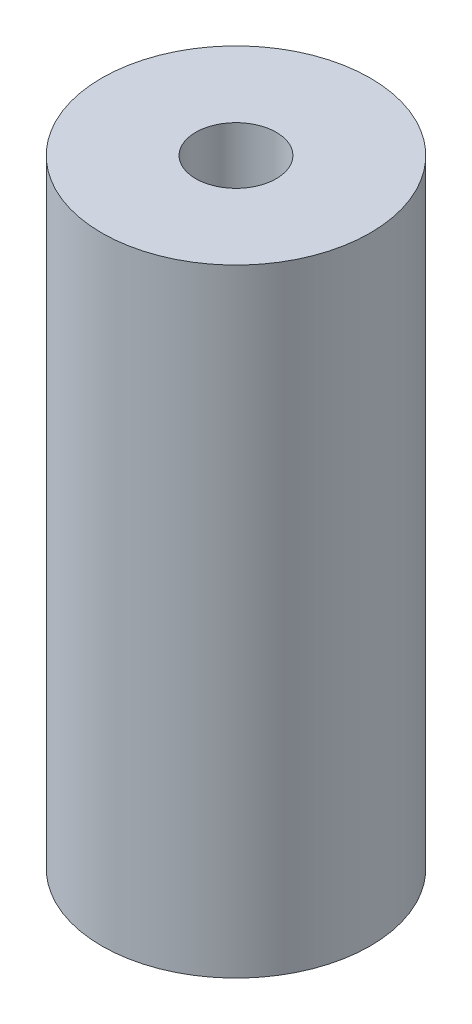
ISO-10303-21;
HEADER;
FILE_DESCRIPTION(('STEP AP214'),'2;1');
FILE_NAME('part.step','',(''),(''),'','','');
FILE_SCHEMA(('AUTOMOTIVE_DESIGN { 1 0 10303 214 1 1 1 1 }'));
ENDSEC;
DATA;
#1=APPLICATION_CONTEXT('core data for automotive mechanical design processes');
#2=APPLICATION_PROTOCOL_DEFINITION('international standard','automotive_design',2000,#1);
#3=PRODUCT_CONTEXT('',#1,'mechanical');
#4=PRODUCT('Part','Part','',(#3));
#5=PRODUCT_RELATED_PRODUCT_CATEGORY('part','',(#4));
#6=PRODUCT_DEFINITION_FORMATION('','',#4);
#7=PRODUCT_DEFINITION_CONTEXT('part definition',#1,'design');
#8=PRODUCT_DEFINITION('design','',#6,#7);
#9=PRODUCT_DEFINITION_SHAPE('','',#8);
#10=(LENGTH_UNIT() NAMED_UNIT(*) SI_UNIT(.MILLI.,.METRE.));
#11=(NAMED_UNIT(*) PLANE_ANGLE_UNIT() SI_UNIT($,.RADIAN.));
#12=(NAMED_UNIT(*) SI_UNIT($,.STERADIAN.) SOLID_ANGLE_UNIT());
#13=UNCERTAINTY_MEASURE_WITH_UNIT(LENGTH_MEASURE(1.E-05),#10,'distance_accuracy_value','');
#14=(GEOMETRIC_REPRESENTATION_CONTEXT(3) GLOBAL_UNCERTAINTY_ASSIGNED_CONTEXT((#13)) GLOBAL_UNIT_ASSIGNED_CONTEXT((#10,
#11,#12)) REPRESENTATION_CONTEXT('',''));
#15=CARTESIAN_POINT('',(0.,0.,0.));
#16=DIRECTION('',(0.,0.,1.));
#17=DIRECTION('',(1.,0.,0.));
#18=AXIS2_PLACEMENT_3D('',#15,#16,#17);
#19=CARTESIAN_POINT('',(0.,23.,0.));
#20=DIRECTION('',(0.,-1.,0.));
#21=DIRECTION('',(0.,0.,-1.));
#22=AXIS2_PLACEMENT_3D('',#19,#20,#21);
#23=CYLINDRICAL_SURFACE('',#22,5.);
#24=CARTESIAN_POINT('',(0.,23.,0.));
#25=DIRECTION('',(0.,1.,0.));
#26=DIRECTION('',(0.,0.,1.));
#27=AXIS2_PLACEMENT_3D('',#24,#25,#26);
#28=CIRCLE('',#27,5.);
#29=CARTESIAN_POINT('',(0.,23.,5.));
#30=VERTEX_POINT('',#29);
#31=EDGE_CURVE('E10',#30,#30,#28,.T.);
#32=ORIENTED_EDGE('',*,*,#31,.F.);
#33=EDGE_LOOP('',(#32));
#34=FACE_BOUND('',#33,.T.);
#35=CARTESIAN_POINT('',(0.,0.,0.));
#36=DIRECTION('',(0.,1.,0.));
#37=DIRECTION('',(0.,0.,1.));
#38=AXIS2_PLACEMENT_3D('',#35,#36,#37);
#39=CIRCLE('',#38,5.);
#40=CARTESIAN_POINT('',(0.,0.,5.));
#41=VERTEX_POINT('',#40);
#42=EDGE_CURVE('E34',#41,#41,#39,.T.);
#43=ORIENTED_EDGE('',*,*,#42,.T.);
#44=EDGE_LOOP('',(#43));
#45=FACE_BOUND('',#44,.T.);
#46=ADVANCED_FACE('F31',(#34,#45),#23,.T.);
#47=CARTESIAN_POINT('',(0.,23.,0.));
#48=DIRECTION('',(0.,1.,0.));
#49=DIRECTION('',(0.,0.,1.));
#50=AXIS2_PLACEMENT_3D('',#47,#48,#49);
#51=PLANE('',#50);
#52=CARTESIAN_POINT('',(0.,23.,0.));
#53=DIRECTION('',(0.,1.,0.));
#54=DIRECTION('',(0.,0.,1.));
#55=AXIS2_PLACEMENT_3D('',#52,#53,#54);
#56=CIRCLE('',#55,1.5);
#57=CARTESIAN_POINT('',(0.,23.,1.5));
#58=VERTEX_POINT('',#57);
#59=EDGE_CURVE('E43',#58,#58,#56,.T.);
#60=ORIENTED_EDGE('',*,*,#59,.F.);
#61=EDGE_LOOP('',(#60));
#62=FACE_BOUND('',#61,.T.);
#63=ORIENTED_EDGE('',*,*,#31,.T.);
#64=EDGE_LOOP('',(#63));
#65=FACE_BOUND('',#64,.T.);
#66=ADVANCED_FACE('F68',(#62,#65),#51,.T.);
#67=CARTESIAN_POINT('',(0.,0.,0.));
#68=DIRECTION('',(0.,1.,0.));
#69=DIRECTION('',(0.,0.,1.));
#70=AXIS2_PLACEMENT_3D('',#67,#68,#69);
#71=PLANE('',#70);
#72=CARTESIAN_POINT('',(0.,0.,0.));
#73=DIRECTION('',(0.,-1.,0.));
#74=DIRECTION('',(0.,0.,-1.));
#75=AXIS2_PLACEMENT_3D('',#72,#73,#74);
#76=CIRCLE('',#75,1.5);
#77=CARTESIAN_POINT('',(0.,0.,-1.5));
#78=VERTEX_POINT('',#77);
#79=EDGE_CURVE('E49',#78,#78,#76,.T.);
#80=ORIENTED_EDGE('',*,*,#79,.F.);
#81=EDGE_LOOP('',(#80));
#82=FACE_BOUND('',#81,.T.);
#83=ORIENTED_EDGE('',*,*,#42,.F.);
#84=EDGE_LOOP('',(#83));
#85=FACE_BOUND('',#84,.T.);
#86=ADVANCED_FACE('F64',(#82,#85),#71,.F.);
#87=CARTESIAN_POINT('',(0.,18.,0.));
#88=DIRECTION('',(0.,1.,0.));
#89=DIRECTION('',(0.,0.,1.));
#90=AXIS2_PLACEMENT_3D('',#87,#88,#89);
#91=CYLINDRICAL_SURFACE('',#90,1.5);
#92=CARTESIAN_POINT('',(0.,18.,0.));
#93=DIRECTION('',(0.,1.,0.));
#94=DIRECTION('',(0.,0.,1.));
#95=AXIS2_PLACEMENT_3D('',#92,#93,#94);
#96=CIRCLE('',#95,1.5);
#97=CARTESIAN_POINT('',(0.,18.,1.5));
#98=VERTEX_POINT('',#97);
#99=EDGE_CURVE('E41',#98,#98,#96,.T.);
#100=ORIENTED_EDGE('',*,*,#99,.F.);
#101=EDGE_LOOP('',(#100));
#102=FACE_BOUND('',#101,.T.);
#103=ORIENTED_EDGE('',*,*,#59,.T.);
#104=EDGE_LOOP('',(#103));
#105=FACE_BOUND('',#104,.T.);
#106=ADVANCED_FACE('F67',(#102,#105),#91,.F.);
#107=CARTESIAN_POINT('',(0.,18.,0.));
#108=DIRECTION('',(0.,1.,0.));
#109=DIRECTION('',(0.,0.,1.));
#110=AXIS2_PLACEMENT_3D('',#107,#108,#109);
#111=PLANE('',#110);
#112=ORIENTED_EDGE('',*,*,#99,.T.);
#113=EDGE_LOOP('',(#112));
#114=FACE_BOUND('',#113,.T.);
#115=ADVANCED_FACE('F60',(#114),#111,.T.);
#116=CARTESIAN_POINT('',(0.,5.,0.));
#117=DIRECTION('',(0.,-1.,0.));
#118=DIRECTION('',(0.,0.,-1.));
#119=AXIS2_PLACEMENT_3D('',#116,#117,#118);
#120=CYLINDRICAL_SURFACE('',#119,1.5);
#121=CARTESIAN_POINT('',(0.,5.,0.));
#122=DIRECTION('',(0.,-1.,0.));
#123=DIRECTION('',(0.,0.,-1.));
#124=AXIS2_PLACEMENT_3D('',#121,#122,#123);
#125=CIRCLE('',#124,1.5);
#126=CARTESIAN_POINT('',(0.,5.,-1.5));
#127=VERTEX_POINT('',#126);
#128=EDGE_CURVE('E46',#127,#127,#125,.T.);
#129=ORIENTED_EDGE('',*,*,#128,.F.);
#130=EDGE_LOOP('',(#129));
#131=FACE_BOUND('',#130,.T.);
#132=ORIENTED_EDGE('',*,*,#79,.T.);
#133=EDGE_LOOP('',(#132));
#134=FACE_BOUND('',#133,.T.);
#135=ADVANCED_FACE('F57',(#131,#134),#120,.F.);
#136=CARTESIAN_POINT('',(0.,5.,0.));
#137=DIRECTION('',(0.,-1.,0.));
#138=DIRECTION('',(0.,0.,-1.));
#139=AXIS2_PLACEMENT_3D('',#136,#137,#138);
#140=PLANE('',#139);
#141=ORIENTED_EDGE('',*,*,#128,.T.);
#142=EDGE_LOOP('',(#141));
#143=FACE_BOUND('',#142,.T.);
#144=ADVANCED_FACE('F55',(#143),#140,.T.);
#145=CLOSED_SHELL('',(#46,#66,#86,#106,#115,#135,#144));
#146=MANIFOLD_SOLID_BREP('B2',#145);
#147=ADVANCED_BREP_SHAPE_REPRESENTATION('',(#18,#146),#14);
#148=SHAPE_DEFINITION_REPRESENTATION(#9,#147);
ENDSEC;
END-ISO-10303-21;
